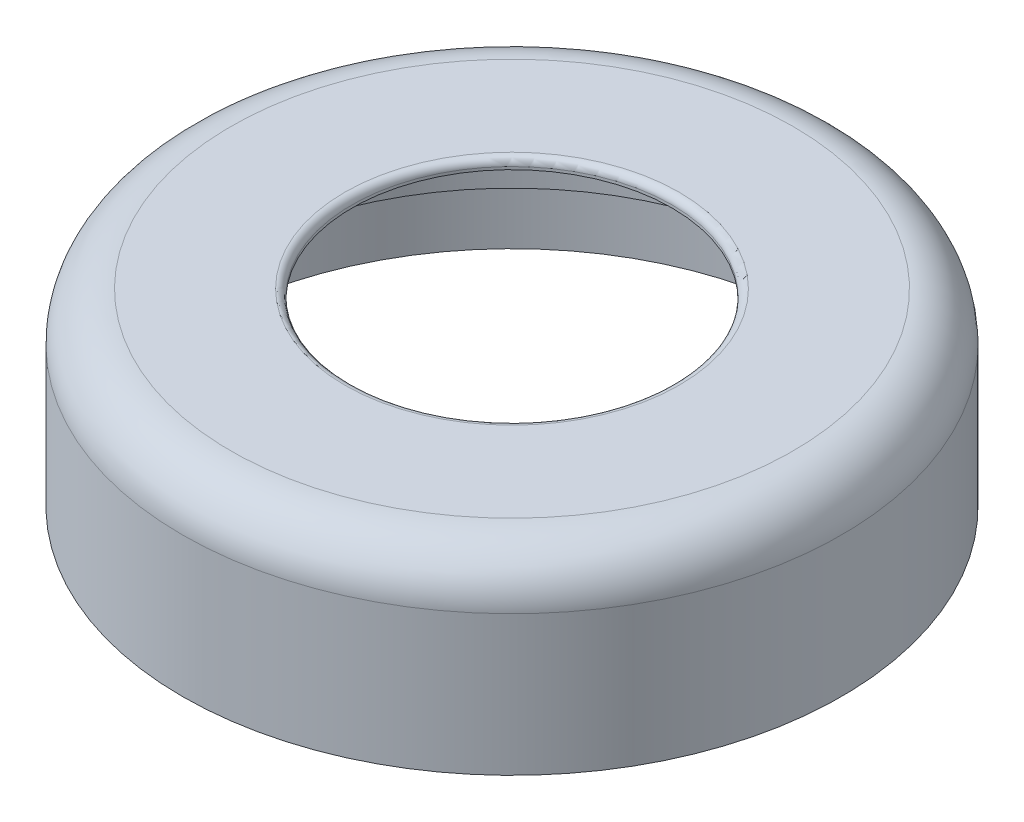
ISO-10303-21;
HEADER;
FILE_DESCRIPTION(('STEP AP214'),'2;1');
FILE_NAME('part.step','',(''),(''),'','','');
FILE_SCHEMA(('AUTOMOTIVE_DESIGN { 1 0 10303 214 1 1 1 1 }'));
ENDSEC;
DATA;
#1=APPLICATION_CONTEXT('core data for automotive mechanical design processes');
#2=APPLICATION_PROTOCOL_DEFINITION('international standard','automotive_design',2000,#1);
#3=PRODUCT_CONTEXT('',#1,'mechanical');
#4=PRODUCT('Part','Part','',(#3));
#5=PRODUCT_RELATED_PRODUCT_CATEGORY('part','',(#4));
#6=PRODUCT_DEFINITION_FORMATION('','',#4);
#7=PRODUCT_DEFINITION_CONTEXT('part definition',#1,'design');
#8=PRODUCT_DEFINITION('design','',#6,#7);
#9=PRODUCT_DEFINITION_SHAPE('','',#8);
#10=(LENGTH_UNIT() NAMED_UNIT(*) SI_UNIT(.MILLI.,.METRE.));
#11=(NAMED_UNIT(*) PLANE_ANGLE_UNIT() SI_UNIT($,.RADIAN.));
#12=(NAMED_UNIT(*) SI_UNIT($,.STERADIAN.) SOLID_ANGLE_UNIT());
#13=UNCERTAINTY_MEASURE_WITH_UNIT(LENGTH_MEASURE(1.E-05),#10,'distance_accuracy_value','');
#14=(GEOMETRIC_REPRESENTATION_CONTEXT(3) GLOBAL_UNCERTAINTY_ASSIGNED_CONTEXT((#13)) GLOBAL_UNIT_ASSIGNED_CONTEXT((#10,
#11,#12)) REPRESENTATION_CONTEXT('',''));
#15=CARTESIAN_POINT('',(0.,0.,0.));
#16=DIRECTION('',(0.,0.,1.));
#17=DIRECTION('',(1.,0.,0.));
#18=AXIS2_PLACEMENT_3D('',#15,#16,#17);
#19=CARTESIAN_POINT('',(30.3,7.69701662474131,0.));
#20=DIRECTION('',(0.,-1.,0.));
#21=DIRECTION('',(0.,0.,-1.));
#22=AXIS2_PLACEMENT_3D('',#19,#20,#21);
#23=PLANE('',#22);
#24=DIRECTION('',(0.,0.,-1.));
#25=VECTOR('',#24,1.);
#26=CARTESIAN_POINT('',(4.99999999999904,7.69701662474131,-30.163682935883));
#27=LINE('',#26,#25);
#28=CARTESIAN_POINT('',(4.99999999999904,7.69701662474131,-30.163682935883));
#29=VERTEX_POINT('',#28);
#30=CARTESIAN_POINT('',(4.99999999999905,7.69701662474131,-32.163682935883));
#31=VERTEX_POINT('',#30);
#32=EDGE_CURVE('E160',#29,#31,#27,.T.);
#33=ORIENTED_EDGE('',*,*,#32,.T.);
#34=CARTESIAN_POINT('',(0.,7.69701662474131,0.));
#35=DIRECTION('',(0.,-1.,0.));
#36=DIRECTION('',(0.,0.,-1.));
#37=AXIS2_PLACEMENT_3D('',#34,#35,#36);
#38=CIRCLE('',#37,32.55);
#39=CARTESIAN_POINT('',(30.3545665017422,7.69701662474131,11.7517144490201));
#40=VERTEX_POINT('',#39);
#41=EDGE_CURVE('E256',#31,#40,#38,.T.);
#42=ORIENTED_EDGE('',*,*,#41,.T.);
#43=DIRECTION('',(-0.86602540378444,0.,-0.499999999999998));
#44=VECTOR('',#43,1.);
#45=CARTESIAN_POINT('',(28.6225156941733,7.69701662474131,10.7517144490201));
#46=LINE('',#45,#44);
#47=CARTESIAN_POINT('',(28.6225156941733,7.69701662474131,10.7517144490201));
#48=VERTEX_POINT('',#47);
#49=EDGE_CURVE('E220',#40,#48,#46,.T.);
#50=ORIENTED_EDGE('',*,*,#49,.T.);
#51=DIRECTION('',(-0.500000000000001,0.,0.866025403784438));
#52=VECTOR('',#51,1.);
#53=CARTESIAN_POINT('',(28.6225156941733,7.69701662474131,10.7517144490201));
#54=LINE('',#53,#52);
#55=CARTESIAN_POINT('',(27.5579800566296,7.69701662474131,12.5955442597136));
#56=VERTEX_POINT('',#55);
#57=EDGE_CURVE('E241',#48,#56,#54,.T.);
#58=ORIENTED_EDGE('',*,*,#57,.T.);
#59=CARTESIAN_POINT('',(0.,7.69701662474131,0.));
#60=DIRECTION('',(0.,-1.,0.));
#61=DIRECTION('',(0.,0.,-1.));
#62=AXIS2_PLACEMENT_3D('',#59,#60,#61);
#63=CIRCLE('',#62,30.3);
#64=CARTESIAN_POINT('',(2.87092872491161,7.69701662474131,-30.163682935883));
#65=VERTEX_POINT('',#64);
#66=EDGE_CURVE('E261',#65,#56,#63,.T.);
#67=ORIENTED_EDGE('',*,*,#66,.F.);
#68=DIRECTION('',(1.,0.,0.));
#69=VECTOR('',#68,1.);
#70=CARTESIAN_POINT('',(-4.99999999999904,7.69701662474131,-30.163682935883));
#71=LINE('',#70,#69);
#72=EDGE_CURVE('E60',#65,#29,#71,.T.);
#73=ORIENTED_EDGE('',*,*,#72,.T.);
#74=EDGE_LOOP('',(#33,#42,#50,#58,#67,#73));
#75=FACE_BOUND('',#74,.T.);
#76=ADVANCED_FACE('F45',(#75),#23,.T.);
#77=DIRECTION('',(0.,0.,1.));
#78=VECTOR('',#77,1.);
#79=CARTESIAN_POINT('',(-4.99999999999904,7.69701662474131,-30.163682935883));
#80=LINE('',#79,#78);
#81=CARTESIAN_POINT('',(-4.99999999999904,7.69701662474131,-32.163682935883));
#82=VERTEX_POINT('',#81);
#83=CARTESIAN_POINT('',(-4.99999999999904,7.69701662474131,-30.163682935883));
#84=VERTEX_POINT('',#83);
#85=EDGE_CURVE('E68',#82,#84,#80,.T.);
#86=ORIENTED_EDGE('',*,*,#85,.T.);
#87=CARTESIAN_POINT('',(-2.87092872491161,7.69701662474131,-30.163682935883));
#88=VERTEX_POINT('',#87);
#89=EDGE_CURVE('E192',#84,#88,#71,.T.);
#90=ORIENTED_EDGE('',*,*,#89,.T.);
#91=CARTESIAN_POINT('',(-27.5579800566297,7.69701662474131,12.5955442597135));
#92=VERTEX_POINT('',#91);
#93=EDGE_CURVE('E259',#92,#88,#63,.T.);
#94=ORIENTED_EDGE('',*,*,#93,.F.);
#95=DIRECTION('',(-0.5,0.,-0.866025403784439));
#96=VECTOR('',#95,1.);
#97=CARTESIAN_POINT('',(-23.6225156941743,7.69701662474131,19.4119684868628));
#98=LINE('',#97,#96);
#99=CARTESIAN_POINT('',(-28.6225156941734,7.69701662474131,10.7517144490201));
#100=VERTEX_POINT('',#99);
#101=EDGE_CURVE('E198',#92,#100,#98,.T.);
#102=ORIENTED_EDGE('',*,*,#101,.T.);
#103=DIRECTION('',(-0.866025403784442,0.,0.499999999999995));
#104=VECTOR('',#103,1.);
#105=CARTESIAN_POINT('',(-28.6225156941734,7.69701662474131,10.7517144490201));
#106=LINE('',#105,#104);
#107=CARTESIAN_POINT('',(-30.3545665017422,7.69701662474131,11.7517144490201));
#108=VERTEX_POINT('',#107);
#109=EDGE_CURVE('E211',#100,#108,#106,.T.);
#110=ORIENTED_EDGE('',*,*,#109,.T.);
#111=EDGE_CURVE('E254',#108,#82,#38,.T.);
#112=ORIENTED_EDGE('',*,*,#111,.T.);
#113=EDGE_LOOP('',(#86,#90,#94,#102,#110,#112));
#114=FACE_BOUND('',#113,.T.);
#115=ADVANCED_FACE('F307',(#114),#23,.T.);
#116=CARTESIAN_POINT('',(0.,0.,0.));
#117=DIRECTION('',(0.,-1.,0.));
#118=DIRECTION('',(0.,0.,-1.));
#119=AXIS2_PLACEMENT_3D('',#116,#117,#118);
#120=CYLINDRICAL_SURFACE('',#119,32.55);
#121=DIRECTION('',(0.,-1.,0.));
#122=VECTOR('',#121,1.);
#123=CARTESIAN_POINT('',(4.99999999999906,19.4716085986202,-32.163682935883));
#124=LINE('',#123,#122);
#125=CARTESIAN_POINT('',(4.99999999999906,0.697016624741309,-32.163682935883));
#126=VERTEX_POINT('',#125);
#127=EDGE_CURVE('E186',#31,#126,#124,.T.);
#128=ORIENTED_EDGE('',*,*,#127,.T.);
#129=CARTESIAN_POINT('',(0.,0.697016624741309,0.));
#130=DIRECTION('',(0.,-1.,0.));
#131=DIRECTION('',(0.,0.,-1.));
#132=AXIS2_PLACEMENT_3D('',#129,#130,#131);
#133=CIRCLE('',#132,32.55);
#134=CARTESIAN_POINT('',(30.3545665017422,0.697016624741309,11.7517144490201));
#135=VERTEX_POINT('',#134);
#136=EDGE_CURVE('E175',#126,#135,#133,.T.);
#137=ORIENTED_EDGE('',*,*,#136,.T.);
#138=DIRECTION('',(0.,-1.,0.));
#139=VECTOR('',#138,1.);
#140=CARTESIAN_POINT('',(30.3545665017422,19.4716085986202,11.7517144490201));
#141=LINE('',#140,#139);
#142=EDGE_CURVE('E226',#40,#135,#141,.T.);
#143=ORIENTED_EDGE('',*,*,#142,.F.);
#144=ORIENTED_EDGE('',*,*,#41,.F.);
#145=EDGE_LOOP('',(#128,#137,#143,#144));
#146=FACE_BOUND('',#145,.T.);
#147=ADVANCED_FACE('F304',(#146),#120,.F.);
#148=DIRECTION('',(0.,-1.,0.));
#149=VECTOR('',#148,1.);
#150=CARTESIAN_POINT('',(-4.99999999999904,19.4716085986202,-32.163682935883));
#151=LINE('',#150,#149);
#152=CARTESIAN_POINT('',(-4.99999999999904,0.697016624741309,-32.163682935883));
#153=VERTEX_POINT('',#152);
#154=EDGE_CURVE('E188',#82,#153,#151,.T.);
#155=ORIENTED_EDGE('',*,*,#154,.F.);
#156=ORIENTED_EDGE('',*,*,#111,.F.);
#157=DIRECTION('',(0.,-1.,0.));
#158=VECTOR('',#157,1.);
#159=CARTESIAN_POINT('',(-30.3545665017423,19.4716085986202,11.7517144490201));
#160=LINE('',#159,#158);
#161=CARTESIAN_POINT('',(-30.3545665017423,0.697016624741309,11.7517144490201));
#162=VERTEX_POINT('',#161);
#163=EDGE_CURVE('E206',#108,#162,#160,.T.);
#164=ORIENTED_EDGE('',*,*,#163,.T.);
#165=EDGE_CURVE('E252',#162,#153,#133,.T.);
#166=ORIENTED_EDGE('',*,*,#165,.T.);
#167=EDGE_LOOP('',(#155,#156,#164,#166));
#168=FACE_BOUND('',#167,.T.);
#169=ADVANCED_FACE('F305',(#168),#120,.F.);
#170=CARTESIAN_POINT('',(32.55,0.697016624741309,0.));
#171=DIRECTION('',(0.,-1.,0.));
#172=DIRECTION('',(0.,0.,-1.));
#173=AXIS2_PLACEMENT_3D('',#170,#171,#172);
#174=PLANE('',#173);
#175=CARTESIAN_POINT('',(0.,0.697016624741309,0.));
#176=DIRECTION('',(0.,-1.,0.));
#177=DIRECTION('',(0.,0.,-1.));
#178=AXIS2_PLACEMENT_3D('',#175,#176,#177);
#179=CIRCLE('',#178,34.);
#180=CARTESIAN_POINT('',(0.,0.697016624741309,-34.));
#181=VERTEX_POINT('',#180);
#182=EDGE_CURVE('E280',#181,#181,#179,.T.);
#183=ORIENTED_EDGE('',*,*,#182,.T.);
#184=EDGE_LOOP('',(#183));
#185=FACE_BOUND('',#184,.T.);
#186=ORIENTED_EDGE('',*,*,#136,.F.);
#187=DIRECTION('',(0.,0.,1.));
#188=VECTOR('',#187,1.);
#189=CARTESIAN_POINT('',(4.99999999999904,0.697016624741309,-30.163682935883));
#190=LINE('',#189,#188);
#191=CARTESIAN_POINT('',(4.99999999999904,0.697016624741309,-30.163682935883));
#192=VERTEX_POINT('',#191);
#193=EDGE_CURVE('E159',#126,#192,#190,.T.);
#194=ORIENTED_EDGE('',*,*,#193,.T.);
#195=DIRECTION('',(-1.,0.,0.));
#196=VECTOR('',#195,1.);
#197=CARTESIAN_POINT('',(-4.99999999999904,0.697016624741309,-30.163682935883));
#198=LINE('',#197,#196);
#199=CARTESIAN_POINT('',(-4.99999999999904,0.697016624741309,-30.163682935883));
#200=VERTEX_POINT('',#199);
#201=EDGE_CURVE('E166',#192,#200,#198,.T.);
#202=ORIENTED_EDGE('',*,*,#201,.T.);
#203=DIRECTION('',(0.,0.,-1.));
#204=VECTOR('',#203,1.);
#205=CARTESIAN_POINT('',(-4.99999999999904,0.697016624741309,-30.163682935883));
#206=LINE('',#205,#204);
#207=EDGE_CURVE('E163',#200,#153,#206,.T.);
#208=ORIENTED_EDGE('',*,*,#207,.T.);
#209=ORIENTED_EDGE('',*,*,#165,.F.);
#210=DIRECTION('',(0.866025403784441,0.,-0.499999999999995));
#211=VECTOR('',#210,1.);
#212=CARTESIAN_POINT('',(-28.6225156941734,0.697016624741309,10.7517144490201));
#213=LINE('',#212,#211);
#214=CARTESIAN_POINT('',(-28.6225156941734,0.697016624741309,10.7517144490201));
#215=VERTEX_POINT('',#214);
#216=EDGE_CURVE('E202',#162,#215,#213,.T.);
#217=ORIENTED_EDGE('',*,*,#216,.T.);
#218=DIRECTION('',(0.5,0.,0.866025403784439));
#219=VECTOR('',#218,1.);
#220=CARTESIAN_POINT('',(-23.6225156941743,0.697016624741309,19.4119684868628));
#221=LINE('',#220,#219);
#222=CARTESIAN_POINT('',(-23.6225156941743,0.697016624741309,19.4119684868628));
#223=VERTEX_POINT('',#222);
#224=EDGE_CURVE('E177',#215,#223,#221,.T.);
#225=ORIENTED_EDGE('',*,*,#224,.T.);
#226=DIRECTION('',(-0.866025403784437,0.,0.500000000000002));
#227=VECTOR('',#226,1.);
#228=CARTESIAN_POINT('',(-23.6225156941743,0.697016624741309,19.4119684868628));
#229=LINE('',#228,#227);
#230=CARTESIAN_POINT('',(-25.3545665017432,0.697016624741309,20.4119684868628));
#231=VERTEX_POINT('',#230);
#232=EDGE_CURVE('E180',#223,#231,#229,.T.);
#233=ORIENTED_EDGE('',*,*,#232,.T.);
#234=CARTESIAN_POINT('',(25.3545665017436,0.697016624741309,20.4119684868624));
#235=VERTEX_POINT('',#234);
#236=EDGE_CURVE('E255',#235,#231,#133,.T.);
#237=ORIENTED_EDGE('',*,*,#236,.F.);
#238=DIRECTION('',(-0.866025403784595,0.,-0.499999999999729));
#239=VECTOR('',#238,1.);
#240=CARTESIAN_POINT('',(23.6225156941743,0.697016624741309,19.4119684868629));
#241=LINE('',#240,#239);
#242=CARTESIAN_POINT('',(23.6225156941743,0.697016624741309,19.4119684868629));
#243=VERTEX_POINT('',#242);
#244=EDGE_CURVE('E225',#235,#243,#241,.T.);
#245=ORIENTED_EDGE('',*,*,#244,.T.);
#246=DIRECTION('',(0.500000000000001,0.,-0.866025403784438));
#247=VECTOR('',#246,1.);
#248=CARTESIAN_POINT('',(28.6225156941733,0.697016624741309,10.7517144490201));
#249=LINE('',#248,#247);
#250=CARTESIAN_POINT('',(28.6225156941733,0.697016624741309,10.7517144490201));
#251=VERTEX_POINT('',#250);
#252=EDGE_CURVE('E199',#243,#251,#249,.T.);
#253=ORIENTED_EDGE('',*,*,#252,.T.);
#254=DIRECTION('',(0.86602540378444,0.,0.499999999999998));
#255=VECTOR('',#254,1.);
#256=CARTESIAN_POINT('',(28.6225156941733,0.697016624741309,10.7517144490201));
#257=LINE('',#256,#255);
#258=EDGE_CURVE('E237',#251,#135,#257,.T.);
#259=ORIENTED_EDGE('',*,*,#258,.T.);
#260=EDGE_LOOP('',(#186,#194,#202,#208,#209,#217,#225,#233,#237,#245,#253,#259));
#261=FACE_BOUND('',#260,.T.);
#262=ADVANCED_FACE('F173',(#185,#261),#174,.T.);
#263=CARTESIAN_POINT('',(0.,0.,0.));
#264=DIRECTION('',(0.,-1.,0.));
#265=DIRECTION('',(0.,0.,-1.));
#266=AXIS2_PLACEMENT_3D('',#263,#264,#265);
#267=CYLINDRICAL_SURFACE('',#266,34.);
#268=CARTESIAN_POINT('',(0.,15.1383772886496,0.));
#269=DIRECTION('',(0.,-1.,0.));
#270=DIRECTION('',(0.,0.,-1.));
#271=AXIS2_PLACEMENT_3D('',#268,#269,#270);
#272=CIRCLE('',#271,34.);
#273=CARTESIAN_POINT('',(0.,15.1383772886496,-34.));
#274=VERTEX_POINT('',#273);
#275=EDGE_CURVE('E277',#274,#274,#272,.T.);
#276=ORIENTED_EDGE('',*,*,#275,.T.);
#277=EDGE_LOOP('',(#276));
#278=FACE_BOUND('',#277,.T.);
#279=ORIENTED_EDGE('',*,*,#182,.F.);
#280=EDGE_LOOP('',(#279));
#281=FACE_BOUND('',#280,.T.);
#282=ADVANCED_FACE('F469',(#278,#281),#267,.T.);
#283=CARTESIAN_POINT('',(0.,15.1383772886496,0.));
#284=DIRECTION('',(0.,-1.,0.));
#285=DIRECTION('',(0.,0.,-1.));
#286=AXIS2_PLACEMENT_3D('',#283,#284,#285);
#287=TOROIDAL_SURFACE('',#286,29.,5.);
#288=CARTESIAN_POINT('',(0.,20.1383772886496,0.));
#289=DIRECTION('',(0.,-1.,0.));
#290=DIRECTION('',(0.,0.,-1.));
#291=AXIS2_PLACEMENT_3D('',#288,#289,#290);
#292=CIRCLE('',#291,29.);
#293=CARTESIAN_POINT('',(0.,20.1383772886496,-29.));
#294=VERTEX_POINT('',#293);
#295=EDGE_CURVE('E274',#294,#294,#292,.T.);
#296=ORIENTED_EDGE('',*,*,#295,.T.);
#297=EDGE_LOOP('',(#296));
#298=FACE_BOUND('',#297,.T.);
#299=ORIENTED_EDGE('',*,*,#275,.F.);
#300=EDGE_LOOP('',(#299));
#301=FACE_BOUND('',#300,.T.);
#302=ADVANCED_FACE('F536',(#298,#301),#287,.T.);
#303=CARTESIAN_POINT('',(16.4981201453027,20.1383772886496,0.));
#304=DIRECTION('',(0.,1.,0.));
#305=DIRECTION('',(0.,0.,1.));
#306=AXIS2_PLACEMENT_3D('',#303,#304,#305);
#307=PLANE('',#306);
#308=CARTESIAN_POINT('',(0.,20.1383772886496,0.));
#309=DIRECTION('',(0.,1.,0.));
#310=DIRECTION('',(0.,0.,1.));
#311=AXIS2_PLACEMENT_3D('',#308,#309,#310);
#312=CIRCLE('',#311,17.2481201453027);
#313=CARTESIAN_POINT('',(0.,20.1383772886496,17.2481201453027));
#314=VERTEX_POINT('',#313);
#315=EDGE_CURVE('E53',#314,#314,#312,.F.);
#316=ORIENTED_EDGE('',*,*,#315,.T.);
#317=EDGE_LOOP('',(#316));
#318=FACE_BOUND('',#317,.T.);
#319=ORIENTED_EDGE('',*,*,#295,.F.);
#320=EDGE_LOOP('',(#319));
#321=FACE_BOUND('',#320,.T.);
#322=ADVANCED_FACE('F285',(#318,#321),#307,.T.);
#323=CARTESIAN_POINT('',(0.,0.,0.));
#324=DIRECTION('',(0.,-1.,0.));
#325=DIRECTION('',(0.,0.,-1.));
#326=AXIS2_PLACEMENT_3D('',#323,#324,#325);
#327=CYLINDRICAL_SURFACE('',#326,16.4981201453027);
#328=CARTESIAN_POINT('',(0.,19.3883772886496,0.));
#329=DIRECTION('',(0.,1.,0.));
#330=DIRECTION('',(0.,0.,1.));
#331=AXIS2_PLACEMENT_3D('',#328,#329,#330);
#332=CIRCLE('',#331,16.4981201453027);
#333=CARTESIAN_POINT('',(0.,19.3883772886496,16.4981201453027));
#334=VERTEX_POINT('',#333);
#335=EDGE_CURVE('E11',#334,#334,#332,.T.);
#336=ORIENTED_EDGE('',*,*,#335,.T.);
#337=EDGE_LOOP('',(#336));
#338=FACE_BOUND('',#337,.T.);
#339=CARTESIAN_POINT('',(0.,19.1101743464799,0.));
#340=DIRECTION('',(0.,-1.,0.));
#341=DIRECTION('',(0.,0.,-1.));
#342=AXIS2_PLACEMENT_3D('',#339,#340,#341);
#343=CIRCLE('',#342,16.4981201453027);
#344=CARTESIAN_POINT('',(0.,19.1101743464799,-16.4981201453027));
#345=VERTEX_POINT('',#344);
#346=EDGE_CURVE('E271',#345,#345,#343,.T.);
#347=ORIENTED_EDGE('',*,*,#346,.T.);
#348=EDGE_LOOP('',(#347));
#349=FACE_BOUND('',#348,.T.);
#350=ADVANCED_FACE('F556',(#338,#349),#327,.F.);
#351=CARTESIAN_POINT('',(27.3,19.1101743464799,0.));
#352=DIRECTION('',(0.,-1.,0.));
#353=DIRECTION('',(0.,0.,-1.));
#354=AXIS2_PLACEMENT_3D('',#351,#352,#353);
#355=PLANE('',#354);
#356=CARTESIAN_POINT('',(0.,19.1101743464799,0.));
#357=DIRECTION('',(0.,-1.,0.));
#358=DIRECTION('',(0.,0.,-1.));
#359=AXIS2_PLACEMENT_3D('',#356,#357,#358);
#360=CIRCLE('',#359,27.3);
#361=CARTESIAN_POINT('',(0.,19.1101743464799,-27.3));
#362=VERTEX_POINT('',#361);
#363=EDGE_CURVE('E268',#362,#362,#360,.T.);
#364=ORIENTED_EDGE('',*,*,#363,.T.);
#365=EDGE_LOOP('',(#364));
#366=FACE_BOUND('',#365,.T.);
#367=ORIENTED_EDGE('',*,*,#346,.F.);
#368=EDGE_LOOP('',(#367));
#369=FACE_BOUND('',#368,.T.);
#370=ADVANCED_FACE('F565',(#366,#369),#355,.T.);
#371=CARTESIAN_POINT('',(0.,16.1101743464799,0.));
#372=DIRECTION('',(0.,-1.,0.));
#373=DIRECTION('',(0.,0.,-1.));
#374=AXIS2_PLACEMENT_3D('',#371,#372,#373);
#375=TOROIDAL_SURFACE('',#374,27.3,3.);
#376=CARTESIAN_POINT('',(0.,16.1101743464799,0.));
#377=DIRECTION('',(0.,-1.,0.));
#378=DIRECTION('',(0.,0.,-1.));
#379=AXIS2_PLACEMENT_3D('',#376,#377,#378);
#380=CIRCLE('',#379,30.3);
#381=CARTESIAN_POINT('',(0.,16.1101743464799,-30.3));
#382=VERTEX_POINT('',#381);
#383=EDGE_CURVE('E264',#382,#382,#380,.T.);
#384=ORIENTED_EDGE('',*,*,#383,.T.);
#385=EDGE_LOOP('',(#384));
#386=FACE_BOUND('',#385,.T.);
#387=ORIENTED_EDGE('',*,*,#363,.F.);
#388=EDGE_LOOP('',(#387));
#389=FACE_BOUND('',#388,.T.);
#390=ADVANCED_FACE('F319',(#386,#389),#375,.F.);
#391=CARTESIAN_POINT('',(0.,0.,0.));
#392=DIRECTION('',(0.,-1.,0.));
#393=DIRECTION('',(0.,0.,-1.));
#394=AXIS2_PLACEMENT_3D('',#391,#392,#393);
#395=CYLINDRICAL_SURFACE('',#394,30.3);
#396=ORIENTED_EDGE('',*,*,#66,.T.);
#397=CARTESIAN_POINT('',(0.,7.69701662474131,0.));
#398=DIRECTION('',(0.,-1.,0.));
#399=DIRECTION('',(0.,0.,-1.));
#400=AXIS2_PLACEMENT_3D('',#397,#398,#399);
#401=CIRCLE('',#400,30.3);
#402=CARTESIAN_POINT('',(24.687051331718,7.69701662474131,17.5681386761695));
#403=VERTEX_POINT('',#402);
#404=EDGE_CURVE('E194',#56,#403,#401,.T.);
#405=ORIENTED_EDGE('',*,*,#404,.T.);
#406=CARTESIAN_POINT('',(-24.687051331718,7.69701662474131,17.5681386761694));
#407=VERTEX_POINT('',#406);
#408=EDGE_CURVE('E265',#403,#407,#63,.T.);
#409=ORIENTED_EDGE('',*,*,#408,.T.);
#410=CARTESIAN_POINT('',(0.,7.69701662474131,0.));
#411=DIRECTION('',(0.,-1.,0.));
#412=DIRECTION('',(0.,0.,-1.));
#413=AXIS2_PLACEMENT_3D('',#410,#411,#412);
#414=CIRCLE('',#413,30.3);
#415=EDGE_CURVE('E247',#407,#92,#414,.T.);
#416=ORIENTED_EDGE('',*,*,#415,.T.);
#417=ORIENTED_EDGE('',*,*,#93,.T.);
#418=CARTESIAN_POINT('',(0.,7.69701662474131,0.));
#419=DIRECTION('',(0.,-1.,0.));
#420=DIRECTION('',(0.,0.,-1.));
#421=AXIS2_PLACEMENT_3D('',#418,#419,#420);
#422=CIRCLE('',#421,30.3);
#423=EDGE_CURVE('E250',#88,#65,#422,.T.);
#424=ORIENTED_EDGE('',*,*,#423,.T.);
#425=EDGE_LOOP('',(#396,#405,#409,#416,#417,#424));
#426=FACE_BOUND('',#425,.T.);
#427=ORIENTED_EDGE('',*,*,#383,.F.);
#428=EDGE_LOOP('',(#427));
#429=FACE_BOUND('',#428,.T.);
#430=ADVANCED_FACE('F314',(#426,#429),#395,.F.);
#431=CARTESIAN_POINT('',(-23.6225156941743,7.69701662474131,19.4119684868628));
#432=VERTEX_POINT('',#431);
#433=EDGE_CURVE('E216',#432,#407,#98,.T.);
#434=ORIENTED_EDGE('',*,*,#433,.T.);
#435=ORIENTED_EDGE('',*,*,#408,.F.);
#436=CARTESIAN_POINT('',(23.6225156941743,7.69701662474131,19.4119684868629));
#437=VERTEX_POINT('',#436);
#438=EDGE_CURVE('E222',#403,#437,#54,.T.);
#439=ORIENTED_EDGE('',*,*,#438,.T.);
#440=DIRECTION('',(0.866025403784595,0.,0.499999999999729));
#441=VECTOR('',#440,1.);
#442=CARTESIAN_POINT('',(23.6225156941743,7.69701662474131,19.4119684868629));
#443=LINE('',#442,#441);
#444=CARTESIAN_POINT('',(25.3545665017436,7.69701662474131,20.4119684868624));
#445=VERTEX_POINT('',#444);
#446=EDGE_CURVE('E234',#437,#445,#443,.T.);
#447=ORIENTED_EDGE('',*,*,#446,.T.);
#448=CARTESIAN_POINT('',(-25.3545665017432,7.69701662474131,20.4119684868629));
#449=VERTEX_POINT('',#448);
#450=EDGE_CURVE('E260',#445,#449,#38,.T.);
#451=ORIENTED_EDGE('',*,*,#450,.T.);
#452=DIRECTION('',(0.866025403784437,0.,-0.500000000000003));
#453=VECTOR('',#452,1.);
#454=CARTESIAN_POINT('',(-23.6225156941743,7.69701662474131,19.4119684868628));
#455=LINE('',#454,#453);
#456=EDGE_CURVE('E196',#449,#432,#455,.T.);
#457=ORIENTED_EDGE('',*,*,#456,.T.);
#458=EDGE_LOOP('',(#434,#435,#439,#447,#451,#457));
#459=FACE_BOUND('',#458,.T.);
#460=ADVANCED_FACE('F301',(#459),#23,.T.);
#461=DIRECTION('',(0.,-1.,0.));
#462=VECTOR('',#461,1.);
#463=CARTESIAN_POINT('',(-25.3545665017432,19.4716085986202,20.4119684868629));
#464=LINE('',#463,#462);
#465=EDGE_CURVE('E203',#449,#231,#464,.T.);
#466=ORIENTED_EDGE('',*,*,#465,.F.);
#467=ORIENTED_EDGE('',*,*,#450,.F.);
#468=DIRECTION('',(0.,-1.,0.));
#469=VECTOR('',#468,1.);
#470=CARTESIAN_POINT('',(25.3545665017436,19.4716085986202,20.4119684868624));
#471=LINE('',#470,#469);
#472=EDGE_CURVE('E229',#445,#235,#471,.T.);
#473=ORIENTED_EDGE('',*,*,#472,.T.);
#474=ORIENTED_EDGE('',*,*,#236,.T.);
#475=EDGE_LOOP('',(#466,#467,#473,#474));
#476=FACE_BOUND('',#475,.T.);
#477=ADVANCED_FACE('F290',(#476),#120,.F.);
#478=CARTESIAN_POINT('',(0.,19.3883772886496,0.));
#479=DIRECTION('',(0.,1.,0.));
#480=DIRECTION('',(0.,0.,1.));
#481=AXIS2_PLACEMENT_3D('',#478,#479,#480);
#482=TOROIDAL_SURFACE('',#481,17.2481201453027,0.75);
#483=ORIENTED_EDGE('',*,*,#335,.F.);
#484=EDGE_LOOP('',(#483));
#485=FACE_BOUND('',#484,.T.);
#486=ORIENTED_EDGE('',*,*,#315,.F.);
#487=EDGE_LOOP('',(#486));
#488=FACE_BOUND('',#487,.T.);
#489=ADVANCED_FACE('F47',(#485,#488),#482,.T.);
#490=CARTESIAN_POINT('',(28.6225156941733,19.4716085986202,10.7517144490201));
#491=DIRECTION('',(-0.866025403784438,0.,-0.500000000000001));
#492=DIRECTION('',(-0.500000000000001,0.,0.866025403784438));
#493=AXIS2_PLACEMENT_3D('',#490,#491,#492);
#494=PLANE('',#493);
#495=ORIENTED_EDGE('',*,*,#57,.F.);
#496=DIRECTION('',(0.,-1.,0.));
#497=VECTOR('',#496,1.);
#498=CARTESIAN_POINT('',(28.6225156941733,19.4716085986202,10.7517144490201));
#499=LINE('',#498,#497);
#500=EDGE_CURVE('E223',#48,#251,#499,.T.);
#501=ORIENTED_EDGE('',*,*,#500,.T.);
#502=ORIENTED_EDGE('',*,*,#252,.F.);
#503=DIRECTION('',(0.,-1.,0.));
#504=VECTOR('',#503,1.);
#505=CARTESIAN_POINT('',(23.6225156941743,19.4716085986202,19.4119684868629));
#506=LINE('',#505,#504);
#507=EDGE_CURVE('E232',#437,#243,#506,.T.);
#508=ORIENTED_EDGE('',*,*,#507,.F.);
#509=ORIENTED_EDGE('',*,*,#438,.F.);
#510=EDGE_CURVE('E243',#56,#403,#54,.T.);
#511=ORIENTED_EDGE('',*,*,#510,.F.);
#512=EDGE_LOOP('',(#495,#501,#502,#508,#509,#511));
#513=FACE_BOUND('',#512,.T.);
#514=ADVANCED_FACE('F289',(#513),#494,.T.);
#515=CARTESIAN_POINT('',(23.6225156941743,19.4716085986202,19.4119684868629));
#516=DIRECTION('',(-0.499999999999729,0.,0.866025403784595));
#517=DIRECTION('',(0.866025403784595,0.,0.499999999999729));
#518=AXIS2_PLACEMENT_3D('',#515,#516,#517);
#519=PLANE('',#518);
#520=ORIENTED_EDGE('',*,*,#446,.F.);
#521=ORIENTED_EDGE('',*,*,#507,.T.);
#522=ORIENTED_EDGE('',*,*,#244,.F.);
#523=ORIENTED_EDGE('',*,*,#472,.F.);
#524=EDGE_LOOP('',(#520,#521,#522,#523));
#525=FACE_BOUND('',#524,.T.);
#526=ADVANCED_FACE('F297',(#525),#519,.T.);
#527=CARTESIAN_POINT('',(28.6225156941733,19.4716085986202,10.7517144490201));
#528=DIRECTION('',(0.499999999999998,0.,-0.86602540378444));
#529=DIRECTION('',(-0.86602540378444,0.,-0.499999999999998));
#530=AXIS2_PLACEMENT_3D('',#527,#528,#529);
#531=PLANE('',#530);
#532=ORIENTED_EDGE('',*,*,#49,.F.);
#533=ORIENTED_EDGE('',*,*,#142,.T.);
#534=ORIENTED_EDGE('',*,*,#258,.F.);
#535=ORIENTED_EDGE('',*,*,#500,.F.);
#536=EDGE_LOOP('',(#532,#533,#534,#535));
#537=FACE_BOUND('',#536,.T.);
#538=ADVANCED_FACE('F362',(#537),#531,.T.);
#539=CARTESIAN_POINT('',(30.3,7.69701662474131,0.));
#540=DIRECTION('',(0.,-1.,0.));
#541=DIRECTION('',(0.,0.,-1.));
#542=AXIS2_PLACEMENT_3D('',#539,#540,#541);
#543=PLANE('',#542);
#544=ORIENTED_EDGE('',*,*,#404,.F.);
#545=ORIENTED_EDGE('',*,*,#510,.T.);
#546=EDGE_LOOP('',(#544,#545));
#547=FACE_BOUND('',#546,.T.);
#548=ADVANCED_FACE('F373',(#547),#543,.F.);
#549=CARTESIAN_POINT('',(-23.6225156941743,19.4716085986202,19.4119684868628));
#550=DIRECTION('',(0.866025403784439,0.,-0.5));
#551=DIRECTION('',(-0.5,0.,-0.866025403784439));
#552=AXIS2_PLACEMENT_3D('',#549,#550,#551);
#553=PLANE('',#552);
#554=ORIENTED_EDGE('',*,*,#433,.F.);
#555=DIRECTION('',(0.,-1.,0.));
#556=VECTOR('',#555,1.);
#557=CARTESIAN_POINT('',(-23.6225156941743,19.4716085986202,19.4119684868628));
#558=LINE('',#557,#556);
#559=EDGE_CURVE('E200',#432,#223,#558,.T.);
#560=ORIENTED_EDGE('',*,*,#559,.T.);
#561=ORIENTED_EDGE('',*,*,#224,.F.);
#562=DIRECTION('',(0.,-1.,0.));
#563=VECTOR('',#562,1.);
#564=CARTESIAN_POINT('',(-28.6225156941734,19.4716085986202,10.7517144490201));
#565=LINE('',#564,#563);
#566=EDGE_CURVE('E209',#100,#215,#565,.T.);
#567=ORIENTED_EDGE('',*,*,#566,.F.);
#568=ORIENTED_EDGE('',*,*,#101,.F.);
#569=EDGE_CURVE('E218',#407,#92,#98,.T.);
#570=ORIENTED_EDGE('',*,*,#569,.F.);
#571=EDGE_LOOP('',(#554,#560,#561,#567,#568,#570));
#572=FACE_BOUND('',#571,.T.);
#573=ADVANCED_FACE('F337',(#572),#553,.T.);
#574=CARTESIAN_POINT('',(-28.6225156941734,19.4716085986202,10.7517144490201));
#575=DIRECTION('',(-0.499999999999995,0.,-0.866025403784441));
#576=DIRECTION('',(-0.866025403784442,0.,0.499999999999995));
#577=AXIS2_PLACEMENT_3D('',#574,#575,#576);
#578=PLANE('',#577);
#579=ORIENTED_EDGE('',*,*,#109,.F.);
#580=ORIENTED_EDGE('',*,*,#566,.T.);
#581=ORIENTED_EDGE('',*,*,#216,.F.);
#582=ORIENTED_EDGE('',*,*,#163,.F.);
#583=EDGE_LOOP('',(#579,#580,#581,#582));
#584=FACE_BOUND('',#583,.T.);
#585=ADVANCED_FACE('F343',(#584),#578,.T.);
#586=CARTESIAN_POINT('',(-23.6225156941743,19.4716085986202,19.4119684868628));
#587=DIRECTION('',(0.500000000000002,0.,0.866025403784437));
#588=DIRECTION('',(0.866025403784437,0.,-0.500000000000003));
#589=AXIS2_PLACEMENT_3D('',#586,#587,#588);
#590=PLANE('',#589);
#591=ORIENTED_EDGE('',*,*,#456,.F.);
#592=ORIENTED_EDGE('',*,*,#465,.T.);
#593=ORIENTED_EDGE('',*,*,#232,.F.);
#594=ORIENTED_EDGE('',*,*,#559,.F.);
#595=EDGE_LOOP('',(#591,#592,#593,#594));
#596=FACE_BOUND('',#595,.T.);
#597=ADVANCED_FACE('F352',(#596),#590,.T.);
#598=CARTESIAN_POINT('',(30.3,7.69701662474131,0.));
#599=DIRECTION('',(0.,-1.,0.));
#600=DIRECTION('',(0.,0.,-1.));
#601=AXIS2_PLACEMENT_3D('',#598,#599,#600);
#602=PLANE('',#601);
#603=ORIENTED_EDGE('',*,*,#415,.F.);
#604=ORIENTED_EDGE('',*,*,#569,.T.);
#605=EDGE_LOOP('',(#603,#604));
#606=FACE_BOUND('',#605,.T.);
#607=ADVANCED_FACE('F336',(#606),#602,.F.);
#608=CARTESIAN_POINT('',(4.99999999999904,19.4716085986202,-30.163682935883));
#609=DIRECTION('',(1.,0.,0.));
#610=DIRECTION('',(0.,0.,-1.));
#611=AXIS2_PLACEMENT_3D('',#608,#609,#610);
#612=PLANE('',#611);
#613=ORIENTED_EDGE('',*,*,#32,.F.);
#614=DIRECTION('',(0.,-1.,0.));
#615=VECTOR('',#614,1.);
#616=CARTESIAN_POINT('',(4.99999999999904,19.4716085986202,-30.163682935883));
#617=LINE('',#616,#615);
#618=EDGE_CURVE('E154',#29,#192,#617,.T.);
#619=ORIENTED_EDGE('',*,*,#618,.T.);
#620=ORIENTED_EDGE('',*,*,#193,.F.);
#621=ORIENTED_EDGE('',*,*,#127,.F.);
#622=EDGE_LOOP('',(#613,#619,#620,#621));
#623=FACE_BOUND('',#622,.T.);
#624=ADVANCED_FACE('F156',(#623),#612,.T.);
#625=CARTESIAN_POINT('',(-4.99999999999904,19.4716085986202,-30.163682935883));
#626=DIRECTION('',(-1.,0.,0.));
#627=DIRECTION('',(0.,0.,1.));
#628=AXIS2_PLACEMENT_3D('',#625,#626,#627);
#629=PLANE('',#628);
#630=ORIENTED_EDGE('',*,*,#85,.F.);
#631=ORIENTED_EDGE('',*,*,#154,.T.);
#632=ORIENTED_EDGE('',*,*,#207,.F.);
#633=DIRECTION('',(0.,-1.,0.));
#634=VECTOR('',#633,1.);
#635=CARTESIAN_POINT('',(-4.99999999999904,19.4716085986202,-30.163682935883));
#636=LINE('',#635,#634);
#637=EDGE_CURVE('E162',#84,#200,#636,.T.);
#638=ORIENTED_EDGE('',*,*,#637,.F.);
#639=EDGE_LOOP('',(#630,#631,#632,#638));
#640=FACE_BOUND('',#639,.T.);
#641=ADVANCED_FACE('F393',(#640),#629,.T.);
#642=CARTESIAN_POINT('',(-4.99999999999904,19.4716085986202,-30.163682935883));
#643=DIRECTION('',(0.,0.,1.));
#644=DIRECTION('',(1.,0.,0.));
#645=AXIS2_PLACEMENT_3D('',#642,#643,#644);
#646=PLANE('',#645);
#647=ORIENTED_EDGE('',*,*,#89,.F.);
#648=ORIENTED_EDGE('',*,*,#637,.T.);
#649=ORIENTED_EDGE('',*,*,#201,.F.);
#650=ORIENTED_EDGE('',*,*,#618,.F.);
#651=ORIENTED_EDGE('',*,*,#72,.F.);
#652=EDGE_CURVE('E195',#88,#65,#71,.T.);
#653=ORIENTED_EDGE('',*,*,#652,.F.);
#654=EDGE_LOOP('',(#647,#648,#649,#650,#651,#653));
#655=FACE_BOUND('',#654,.T.);
#656=ADVANCED_FACE('F168',(#655),#646,.T.);
#657=CARTESIAN_POINT('',(30.3,7.69701662474131,0.));
#658=DIRECTION('',(0.,-1.,0.));
#659=DIRECTION('',(0.,0.,-1.));
#660=AXIS2_PLACEMENT_3D('',#657,#658,#659);
#661=PLANE('',#660);
#662=ORIENTED_EDGE('',*,*,#423,.F.);
#663=ORIENTED_EDGE('',*,*,#652,.T.);
#664=EDGE_LOOP('',(#662,#663));
#665=FACE_BOUND('',#664,.T.);
#666=ADVANCED_FACE('F369',(#665),#661,.F.);
#667=CLOSED_SHELL('',(#76,#115,#147,#169,#262,#282,#302,#322,#350,#370,#390,#430,#460,#477,#489,
#514,#526,#538,#548,#573,#585,#597,#607,#624,#641,#656,#666));
#668=MANIFOLD_SOLID_BREP('B2',#667);
#669=ADVANCED_BREP_SHAPE_REPRESENTATION('',(#18,#668),#14);
#670=SHAPE_DEFINITION_REPRESENTATION(#9,#669);
ENDSEC;
END-ISO-10303-21;
